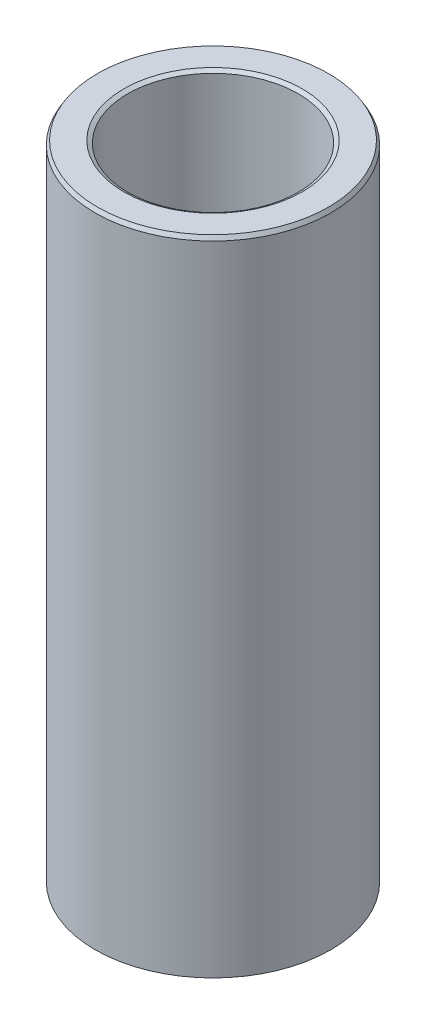
ISO-10303-21;
HEADER;
FILE_DESCRIPTION(('STEP AP214'),'2;1');
FILE_NAME('part.step','',(''),(''),'','','');
FILE_SCHEMA(('AUTOMOTIVE_DESIGN { 1 0 10303 214 1 1 1 1 }'));
ENDSEC;
DATA;
#1=APPLICATION_CONTEXT('core data for automotive mechanical design processes');
#2=APPLICATION_PROTOCOL_DEFINITION('international standard','automotive_design',2000,#1);
#3=PRODUCT_CONTEXT('',#1,'mechanical');
#4=PRODUCT('Part','Part','',(#3));
#5=PRODUCT_RELATED_PRODUCT_CATEGORY('part','',(#4));
#6=PRODUCT_DEFINITION_FORMATION('','',#4);
#7=PRODUCT_DEFINITION_CONTEXT('part definition',#1,'design');
#8=PRODUCT_DEFINITION('design','',#6,#7);
#9=PRODUCT_DEFINITION_SHAPE('','',#8);
#10=(LENGTH_UNIT() NAMED_UNIT(*) SI_UNIT(.MILLI.,.METRE.));
#11=(NAMED_UNIT(*) PLANE_ANGLE_UNIT() SI_UNIT($,.RADIAN.));
#12=(NAMED_UNIT(*) SI_UNIT($,.STERADIAN.) SOLID_ANGLE_UNIT());
#13=UNCERTAINTY_MEASURE_WITH_UNIT(LENGTH_MEASURE(1.E-05),#10,'distance_accuracy_value','');
#14=(GEOMETRIC_REPRESENTATION_CONTEXT(3) GLOBAL_UNCERTAINTY_ASSIGNED_CONTEXT((#13)) GLOBAL_UNIT_ASSIGNED_CONTEXT((#10,
#11,#12)) REPRESENTATION_CONTEXT('',''));
#15=CARTESIAN_POINT('',(0.,0.,0.));
#16=DIRECTION('',(0.,0.,1.));
#17=DIRECTION('',(1.,0.,0.));
#18=AXIS2_PLACEMENT_3D('',#15,#16,#17);
#19=CARTESIAN_POINT('',(0.,245.972160093566,0.));
#20=DIRECTION('',(0.,-1.,0.));
#21=DIRECTION('',(0.,0.,-1.));
#22=AXIS2_PLACEMENT_3D('',#19,#20,#21);
#23=CYLINDRICAL_SURFACE('',#22,45.);
#24=CARTESIAN_POINT('',(0.,0.866650806677138,0.));
#25=DIRECTION('',(0.,1.,0.));
#26=DIRECTION('',(0.,0.,1.));
#27=AXIS2_PLACEMENT_3D('',#24,#25,#26);
#28=CIRCLE('',#27,45.);
#29=CARTESIAN_POINT('',(0.,0.866650806677138,45.));
#30=VERTEX_POINT('',#29);
#31=EDGE_CURVE('E10',#30,#30,#28,.T.);
#32=ORIENTED_EDGE('',*,*,#31,.T.);
#33=EDGE_LOOP('',(#32));
#34=FACE_BOUND('',#33,.T.);
#35=CARTESIAN_POINT('',(0.,244.47107686398,0.));
#36=DIRECTION('',(0.,1.,0.));
#37=DIRECTION('',(0.,0.,1.));
#38=AXIS2_PLACEMENT_3D('',#35,#36,#37);
#39=CIRCLE('',#38,45.);
#40=CARTESIAN_POINT('',(0.,244.47107686398,45.));
#41=VERTEX_POINT('',#40);
#42=EDGE_CURVE('E50',#41,#41,#39,.F.);
#43=ORIENTED_EDGE('',*,*,#42,.T.);
#44=EDGE_LOOP('',(#43));
#45=FACE_BOUND('',#44,.T.);
#46=ADVANCED_FACE('F39',(#34,#45),#23,.T.);
#47=CARTESIAN_POINT('',(0.,245.972160093566,0.));
#48=DIRECTION('',(0.,1.,0.));
#49=DIRECTION('',(0.,0.,1.));
#50=AXIS2_PLACEMENT_3D('',#47,#48,#49);
#51=PLANE('',#50);
#52=CARTESIAN_POINT('',(0.,245.972160093566,0.));
#53=DIRECTION('',(0.,1.,0.));
#54=DIRECTION('',(0.,0.,1.));
#55=AXIS2_PLACEMENT_3D('',#52,#53,#54);
#56=CIRCLE('',#55,34.075812722122);
#57=CARTESIAN_POINT('',(0.,245.972160093566,34.075812722122));
#58=VERTEX_POINT('',#57);
#59=EDGE_CURVE('E58',#58,#58,#56,.F.);
#60=ORIENTED_EDGE('',*,*,#59,.T.);
#61=EDGE_LOOP('',(#60));
#62=FACE_BOUND('',#61,.T.);
#63=CARTESIAN_POINT('',(0.,245.972160093566,0.));
#64=DIRECTION('',(0.,1.,0.));
#65=DIRECTION('',(0.,0.,1.));
#66=AXIS2_PLACEMENT_3D('',#63,#64,#65);
#67=CIRCLE('',#66,44.1333491933228);
#68=CARTESIAN_POINT('',(0.,245.972160093566,44.1333491933228));
#69=VERTEX_POINT('',#68);
#70=EDGE_CURVE('E61',#69,#69,#67,.T.);
#71=ORIENTED_EDGE('',*,*,#70,.T.);
#72=EDGE_LOOP('',(#71));
#73=FACE_BOUND('',#72,.T.);
#74=ADVANCED_FACE('F88',(#62,#73),#51,.T.);
#75=CARTESIAN_POINT('',(0.,0.,0.));
#76=DIRECTION('',(0.,1.,0.));
#77=DIRECTION('',(0.,0.,1.));
#78=AXIS2_PLACEMENT_3D('',#75,#76,#77);
#79=PLANE('',#78);
#80=CARTESIAN_POINT('',(0.,0.,0.));
#81=DIRECTION('',(0.,1.,0.));
#82=DIRECTION('',(0.,0.,1.));
#83=AXIS2_PLACEMENT_3D('',#80,#81,#82);
#84=CIRCLE('',#83,33.4413802992137);
#85=CARTESIAN_POINT('',(0.,0.,33.4413802992137));
#86=VERTEX_POINT('',#85);
#87=EDGE_CURVE('E51',#86,#86,#84,.T.);
#88=ORIENTED_EDGE('',*,*,#87,.T.);
#89=EDGE_LOOP('',(#88));
#90=FACE_BOUND('',#89,.T.);
#91=CARTESIAN_POINT('',(0.,0.,0.));
#92=DIRECTION('',(0.,1.,0.));
#93=DIRECTION('',(0.,0.,1.));
#94=AXIS2_PLACEMENT_3D('',#91,#92,#93);
#95=CIRCLE('',#94,43.4989167704146);
#96=CARTESIAN_POINT('',(0.,0.,43.4989167704146));
#97=VERTEX_POINT('',#96);
#98=EDGE_CURVE('E54',#97,#97,#95,.F.);
#99=ORIENTED_EDGE('',*,*,#98,.T.);
#100=EDGE_LOOP('',(#99));
#101=FACE_BOUND('',#100,.T.);
#102=ADVANCED_FACE('F83',(#90,#101),#79,.F.);
#103=CARTESIAN_POINT('',(0.,245.972160093566,0.));
#104=DIRECTION('',(0.,-1.,0.));
#105=DIRECTION('',(0.,0.,-1.));
#106=AXIS2_PLACEMENT_3D('',#103,#104,#105);
#107=CYLINDRICAL_SURFACE('',#106,32.5747294925366);
#108=CARTESIAN_POINT('',(0.,245.105509286888,0.));
#109=DIRECTION('',(0.,1.,0.));
#110=DIRECTION('',(0.,0.,1.));
#111=AXIS2_PLACEMENT_3D('',#108,#109,#110);
#112=CIRCLE('',#111,32.5747294925366);
#113=CARTESIAN_POINT('',(0.,245.105509286888,32.5747294925366));
#114=VERTEX_POINT('',#113);
#115=EDGE_CURVE('E67',#114,#114,#112,.T.);
#116=ORIENTED_EDGE('',*,*,#115,.T.);
#117=EDGE_LOOP('',(#116));
#118=FACE_BOUND('',#117,.T.);
#119=CARTESIAN_POINT('',(0.,1.50108322958536,0.));
#120=DIRECTION('',(0.,1.,0.));
#121=DIRECTION('',(0.,0.,1.));
#122=AXIS2_PLACEMENT_3D('',#119,#120,#121);
#123=CIRCLE('',#122,32.5747294925366);
#124=CARTESIAN_POINT('',(0.,1.50108322958536,32.5747294925366));
#125=VERTEX_POINT('',#124);
#126=EDGE_CURVE('E69',#125,#125,#123,.F.);
#127=ORIENTED_EDGE('',*,*,#126,.T.);
#128=EDGE_LOOP('',(#127));
#129=FACE_BOUND('',#128,.T.);
#130=ADVANCED_FACE('F71',(#118,#129),#107,.F.);
#131=CARTESIAN_POINT('',(0.,245.105509286888,0.));
#132=DIRECTION('',(0.,1.,0.));
#133=DIRECTION('',(0.,0.,1.));
#134=AXIS2_PLACEMENT_3D('',#131,#132,#133);
#135=CONICAL_SURFACE('',#134,32.5747294925366,1.04719755119659);
#136=CARTESIAN_POINT('',(0.,245.972160093566,34.075812722122));
#137=CARTESIAN_POINT('',(0.,245.963132480996,34.0601764384805));
#138=CARTESIAN_POINT('',(0.,245.954104868426,34.044540154839));
#139=CARTESIAN_POINT('',(0.,245.936049643287,34.013267587556));
#140=CARTESIAN_POINT('',(0.,245.927022030718,33.9976313039144));
#141=CARTESIAN_POINT('',(0.,245.908966805579,33.9663587366314));
#142=CARTESIAN_POINT('',(0.,245.899939193009,33.9507224529899));
#143=CARTESIAN_POINT('',(0.,245.88188396787,33.9194498857069));
#144=CARTESIAN_POINT('',(0.,245.8728563553,33.9038136020653));
#145=CARTESIAN_POINT('',(0.,245.854801130161,33.8725410347823));
#146=CARTESIAN_POINT('',(0.,245.845773517592,33.8569047511408));
#147=CARTESIAN_POINT('',(0.,245.827718292453,33.8256321838578));
#148=CARTESIAN_POINT('',(0.,245.818690679883,33.8099959002163));
#149=CARTESIAN_POINT('',(0.,245.800635454744,33.7787233329332));
#150=CARTESIAN_POINT('',(0.,245.791607842174,33.7630870492917));
#151=CARTESIAN_POINT('',(0.,245.773552617035,33.7318144820087));
#152=CARTESIAN_POINT('',(0.,245.764525004466,33.7161781983672));
#153=CARTESIAN_POINT('',(0.,245.746469779327,33.6849056310841));
#154=CARTESIAN_POINT('',(0.,245.737442166757,33.6692693474426));
#155=CARTESIAN_POINT('',(0.,245.719386941618,33.6379967801596));
#156=CARTESIAN_POINT('',(0.,245.710359329048,33.6223604965181));
#157=CARTESIAN_POINT('',(0.,245.692304103909,33.5910879292351));
#158=CARTESIAN_POINT('',(0.,245.68327649134,33.5754516455935));
#159=CARTESIAN_POINT('',(0.,245.665221266201,33.5441790783105));
#160=CARTESIAN_POINT('',(0.,245.656193653631,33.528542794669));
#161=CARTESIAN_POINT('',(0.,245.638138428492,33.497270227386));
#162=CARTESIAN_POINT('',(0.,245.629110815922,33.4816339437444));
#163=CARTESIAN_POINT('',(0.,245.611055590783,33.4503613764614));
#164=CARTESIAN_POINT('',(0.,245.602027978214,33.4347250928199));
#165=CARTESIAN_POINT('',(0.,245.583972753075,33.4034525255369));
#166=CARTESIAN_POINT('',(0.,245.574945140505,33.3878162418954));
#167=CARTESIAN_POINT('',(0.,245.556889915366,33.3565436746123));
#168=CARTESIAN_POINT('',(0.,245.547862302797,33.3409073909708));
#169=CARTESIAN_POINT('',(0.,245.529807077657,33.3096348236878));
#170=CARTESIAN_POINT('',(0.,245.520779465088,33.2939985400463));
#171=CARTESIAN_POINT('',(0.,245.502724239949,33.2627259727632));
#172=CARTESIAN_POINT('',(0.,245.493696627379,33.2470896891217));
#173=CARTESIAN_POINT('',(0.,245.47564140224,33.2158171218387));
#174=CARTESIAN_POINT('',(0.,245.466613789671,33.2001808381972));
#175=CARTESIAN_POINT('',(0.,245.448558564531,33.1689082709142));
#176=CARTESIAN_POINT('',(0.,245.439530951962,33.1532719872726));
#177=CARTESIAN_POINT('',(0.,245.421475726823,33.1219994199896));
#178=CARTESIAN_POINT('',(0.,245.412448114253,33.1063631363481));
#179=CARTESIAN_POINT('',(0.,245.394392889114,33.0750905690651));
#180=CARTESIAN_POINT('',(0.,245.385365276545,33.0594542854235));
#181=CARTESIAN_POINT('',(0.,245.367310051405,33.0281817181405));
#182=CARTESIAN_POINT('',(0.,245.358282438836,33.012545434499));
#183=CARTESIAN_POINT('',(0.,245.340227213697,32.981272867216));
#184=CARTESIAN_POINT('',(0.,245.331199601127,32.9656365835744));
#185=CARTESIAN_POINT('',(0.,245.313144375988,32.9343640162914));
#186=CARTESIAN_POINT('',(0.,245.304116763419,32.9187277326499));
#187=CARTESIAN_POINT('',(0.,245.286061538279,32.8874551653669));
#188=CARTESIAN_POINT('',(0.,245.27703392571,32.8718188817254));
#189=CARTESIAN_POINT('',(0.,245.258978700571,32.8405463144423));
#190=CARTESIAN_POINT('',(0.,245.249951088001,32.8249100308008));
#191=CARTESIAN_POINT('',(0.,245.231895862862,32.7936374635178));
#192=CARTESIAN_POINT('',(0.,245.222868250293,32.7780011798763));
#193=CARTESIAN_POINT('',(0.,245.204813025153,32.7467286125932));
#194=CARTESIAN_POINT('',(0.,245.195785412584,32.7310923289517));
#195=CARTESIAN_POINT('',(0.,245.177730187445,32.6998197616687));
#196=CARTESIAN_POINT('',(0.,245.168702574875,32.6841834780272));
#197=CARTESIAN_POINT('',(0.,245.150647349736,32.6529109107442));
#198=CARTESIAN_POINT('',(0.,245.141619737167,32.6372746271026));
#199=CARTESIAN_POINT('',(0.,245.123564512027,32.6060020598196));
#200=CARTESIAN_POINT('',(0.,245.114536899458,32.5903657761781));
#201=CARTESIAN_POINT('',(0.,245.105509286888,32.5747294925366));
#202=B_SPLINE_CURVE_WITH_KNOTS('',3,(#136,#137,#138,#139,#140,#141,#142,#143,#144,#145,#146,
#147,#148,#149,#150,#151,#152,#153,#154,#155,#156,#157,#158,#159,#160,#161,#162,#163,#164,#165,
#166,#167,#168,#169,#170,#171,#172,#173,#174,#175,#176,#177,#178,#179,#180,#181,#182,#183,#184,
#185,#186,#187,#188,#189,#190,#191,#192,#193,#194,#195,#196,#197,#198,#199,#200,#201),
.UNSPECIFIED.,.F.,.F.,(4,2,2,2,2,2,2,2,2,2,2,2,2,2,2,2,2,2,2,2,2,2,2,2,2,2,2,2,2,2,2,2,4),(0.,
0.0541656754173246,0.108331350834655,0.16249702625198,0.216662701669304,0.270828377086629,
0.324994052503954,0.379159727921278,0.433325403338603,0.487491078755928,0.541656754173252,
0.595822429590577,0.649988105007907,0.704153780425232,0.758319455842557,0.812485131259881,
0.866650806677192,0.920816482094516,0.974982157511841,1.02914783292917,1.08331350834649,
1.13747918376381,1.19164485918114,1.24581053459847,1.29997621001579,1.35414188543312,
1.40830756085044,1.46247323626777,1.51663891168509,1.57080458710242,1.62497026251974,
1.67913593793707,1.73330161335438),.UNSPECIFIED.);
#203=EDGE_CURVE('BSEAM77',#58,#114,#202,.T.);
#204=ORIENTED_EDGE('',*,*,#59,.F.);
#205=ORIENTED_EDGE('',*,*,#115,.F.);
#206=ORIENTED_EDGE('',*,*,#203,.T.);
#207=ORIENTED_EDGE('',*,*,#203,.F.);
#208=EDGE_LOOP('',(#204,#206,#205,#207));
#209=FACE_BOUND('',#208,.T.);
#210=ADVANCED_FACE('F77',(#209),#135,.F.);
#211=CARTESIAN_POINT('',(0.,0.,0.));
#212=DIRECTION('',(0.,-1.,0.));
#213=DIRECTION('',(0.,0.,-1.));
#214=AXIS2_PLACEMENT_3D('',#211,#212,#213);
#215=CONICAL_SURFACE('',#214,33.4413802992137,0.5235987755983);
#216=ORIENTED_EDGE('',*,*,#126,.F.);
#217=EDGE_LOOP('',(#216));
#218=FACE_BOUND('',#217,.T.);
#219=ORIENTED_EDGE('',*,*,#87,.F.);
#220=EDGE_LOOP('',(#219));
#221=FACE_BOUND('',#220,.T.);
#222=ADVANCED_FACE('F73',(#218,#221),#215,.F.);
#223=CARTESIAN_POINT('',(0.,0.866650806677138,0.));
#224=DIRECTION('',(0.,1.,0.));
#225=DIRECTION('',(0.,0.,1.));
#226=AXIS2_PLACEMENT_3D('',#223,#224,#225);
#227=CONICAL_SURFACE('',#226,45.,1.04719755119661);
#228=ORIENTED_EDGE('',*,*,#98,.F.);
#229=EDGE_LOOP('',(#228));
#230=FACE_BOUND('',#229,.T.);
#231=ORIENTED_EDGE('',*,*,#31,.F.);
#232=EDGE_LOOP('',(#231));
#233=FACE_BOUND('',#232,.T.);
#234=ADVANCED_FACE('F76',(#230,#233),#227,.T.);
#235=CARTESIAN_POINT('',(0.,245.972160093566,0.));
#236=DIRECTION('',(0.,-1.,0.));
#237=DIRECTION('',(0.,0.,-1.));
#238=AXIS2_PLACEMENT_3D('',#235,#236,#237);
#239=CONICAL_SURFACE('',#238,44.1333491933228,0.523598775598299);
#240=ORIENTED_EDGE('',*,*,#42,.F.);
#241=EDGE_LOOP('',(#240));
#242=FACE_BOUND('',#241,.T.);
#243=ORIENTED_EDGE('',*,*,#70,.F.);
#244=EDGE_LOOP('',(#243));
#245=FACE_BOUND('',#244,.T.);
#246=ADVANCED_FACE('F45',(#242,#245),#239,.T.);
#247=CLOSED_SHELL('',(#46,#74,#102,#130,#210,#222,#234,#246));
#248=MANIFOLD_SOLID_BREP('B2',#247);
#249=ADVANCED_BREP_SHAPE_REPRESENTATION('',(#18,#248),#14);
#250=SHAPE_DEFINITION_REPRESENTATION(#9,#249);
ENDSEC;
END-ISO-10303-21;
